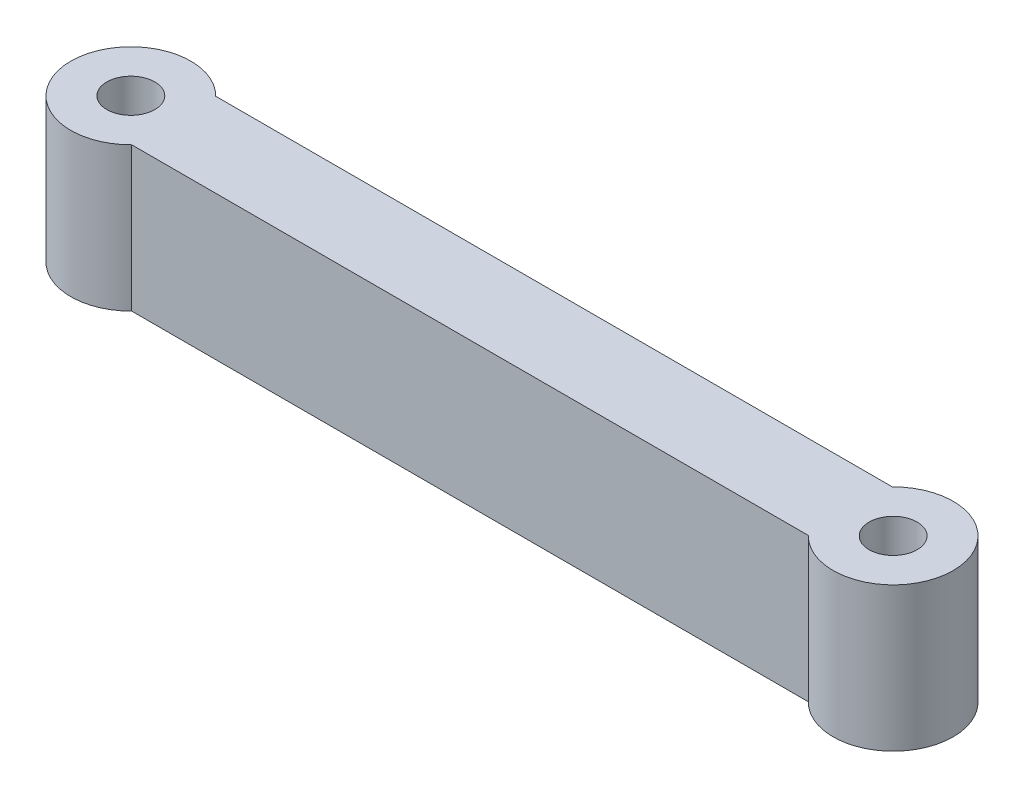
ISO-10303-21;
HEADER;
FILE_DESCRIPTION(('STEP AP214'),'2;1');
FILE_NAME('part.step','',(''),(''),'','','');
FILE_SCHEMA(('AUTOMOTIVE_DESIGN { 1 0 10303 214 1 1 1 1 }'));
ENDSEC;
DATA;
#1=APPLICATION_CONTEXT('core data for automotive mechanical design processes');
#2=APPLICATION_PROTOCOL_DEFINITION('international standard','automotive_design',2000,#1);
#3=PRODUCT_CONTEXT('',#1,'mechanical');
#4=PRODUCT('Part','Part','',(#3));
#5=PRODUCT_RELATED_PRODUCT_CATEGORY('part','',(#4));
#6=PRODUCT_DEFINITION_FORMATION('','',#4);
#7=PRODUCT_DEFINITION_CONTEXT('part definition',#1,'design');
#8=PRODUCT_DEFINITION('design','',#6,#7);
#9=PRODUCT_DEFINITION_SHAPE('','',#8);
#10=(LENGTH_UNIT() NAMED_UNIT(*) SI_UNIT(.MILLI.,.METRE.));
#11=(NAMED_UNIT(*) PLANE_ANGLE_UNIT() SI_UNIT($,.RADIAN.));
#12=(NAMED_UNIT(*) SI_UNIT($,.STERADIAN.) SOLID_ANGLE_UNIT());
#13=UNCERTAINTY_MEASURE_WITH_UNIT(LENGTH_MEASURE(1.E-05),#10,'distance_accuracy_value','');
#14=(GEOMETRIC_REPRESENTATION_CONTEXT(3) GLOBAL_UNCERTAINTY_ASSIGNED_CONTEXT((#13)) GLOBAL_UNIT_ASSIGNED_CONTEXT((#10,
#11,#12)) REPRESENTATION_CONTEXT('',''));
#15=CARTESIAN_POINT('',(0.,0.,0.));
#16=DIRECTION('',(0.,0.,1.));
#17=DIRECTION('',(1.,0.,0.));
#18=AXIS2_PLACEMENT_3D('',#15,#16,#17);
#19=CARTESIAN_POINT('',(0.,12.,0.));
#20=DIRECTION('',(0.,1.,0.));
#21=DIRECTION('',(0.,0.,1.));
#22=AXIS2_PLACEMENT_3D('',#19,#20,#21);
#23=PLANE('',#22);
#24=CARTESIAN_POINT('',(-31.75,12.,0.));
#25=DIRECTION('',(0.,1.,0.));
#26=DIRECTION('',(0.,0.,1.));
#27=AXIS2_PLACEMENT_3D('',#24,#25,#26);
#28=CIRCLE('',#27,2.);
#29=CARTESIAN_POINT('',(-31.75,12.,2.));
#30=VERTEX_POINT('',#29);
#31=EDGE_CURVE('E181',#30,#30,#28,.T.);
#32=ORIENTED_EDGE('',*,*,#31,.F.);
#33=EDGE_LOOP('',(#32));
#34=FACE_BOUND('',#33,.T.);
#35=CARTESIAN_POINT('',(31.75,12.,0.));
#36=DIRECTION('',(0.,1.,0.));
#37=DIRECTION('',(0.,0.,1.));
#38=AXIS2_PLACEMENT_3D('',#35,#36,#37);
#39=CIRCLE('',#38,2.);
#40=CARTESIAN_POINT('',(31.75,12.,2.));
#41=VERTEX_POINT('',#40);
#42=EDGE_CURVE('E183',#41,#41,#39,.T.);
#43=ORIENTED_EDGE('',*,*,#42,.F.);
#44=EDGE_LOOP('',(#43));
#45=FACE_BOUND('',#44,.T.);
#46=CARTESIAN_POINT('',(-31.75,12.,0.));
#47=DIRECTION('',(0.,1.,0.));
#48=DIRECTION('',(0.,0.,1.));
#49=AXIS2_PLACEMENT_3D('',#46,#47,#48);
#50=CIRCLE('',#49,5.);
#51=CARTESIAN_POINT('',(-28.1792857857286,12.,-3.5));
#52=VERTEX_POINT('',#51);
#53=CARTESIAN_POINT('',(-28.1792857857286,12.,3.5));
#54=VERTEX_POINT('',#53);
#55=EDGE_CURVE('E37',#52,#54,#50,.T.);
#56=ORIENTED_EDGE('',*,*,#55,.T.);
#57=DIRECTION('',(1.,0.,0.));
#58=VECTOR('',#57,1.);
#59=CARTESIAN_POINT('',(-28.1792857857286,12.,3.5));
#60=LINE('',#59,#58);
#61=CARTESIAN_POINT('',(28.1792857857286,12.,3.5));
#62=VERTEX_POINT('',#61);
#63=EDGE_CURVE('E48',#54,#62,#60,.T.);
#64=ORIENTED_EDGE('',*,*,#63,.T.);
#65=CARTESIAN_POINT('',(31.75,12.,0.));
#66=DIRECTION('',(0.,1.,0.));
#67=DIRECTION('',(0.,0.,1.));
#68=AXIS2_PLACEMENT_3D('',#65,#66,#67);
#69=CIRCLE('',#68,5.);
#70=CARTESIAN_POINT('',(28.1792857857286,12.,-3.5));
#71=VERTEX_POINT('',#70);
#72=EDGE_CURVE('E103',#62,#71,#69,.T.);
#73=ORIENTED_EDGE('',*,*,#72,.T.);
#74=DIRECTION('',(-1.,0.,0.));
#75=VECTOR('',#74,1.);
#76=CARTESIAN_POINT('',(-28.1792857857286,12.,-3.5));
#77=LINE('',#76,#75);
#78=EDGE_CURVE('E97',#71,#52,#77,.T.);
#79=ORIENTED_EDGE('',*,*,#78,.T.);
#80=EDGE_LOOP('',(#56,#64,#73,#79));
#81=FACE_BOUND('',#80,.T.);
#82=ADVANCED_FACE('F33',(#34,#45,#81),#23,.T.);
#83=CARTESIAN_POINT('',(0.,0.,0.));
#84=DIRECTION('',(0.,1.,0.));
#85=DIRECTION('',(0.,0.,1.));
#86=AXIS2_PLACEMENT_3D('',#83,#84,#85);
#87=PLANE('',#86);
#88=CARTESIAN_POINT('',(-31.75,0.,0.));
#89=DIRECTION('',(0.,1.,0.));
#90=DIRECTION('',(0.,0.,1.));
#91=AXIS2_PLACEMENT_3D('',#88,#89,#90);
#92=CIRCLE('',#91,2.);
#93=CARTESIAN_POINT('',(-31.75,0.,2.));
#94=VERTEX_POINT('',#93);
#95=EDGE_CURVE('E179',#94,#94,#92,.T.);
#96=ORIENTED_EDGE('',*,*,#95,.T.);
#97=EDGE_LOOP('',(#96));
#98=FACE_BOUND('',#97,.T.);
#99=CARTESIAN_POINT('',(31.75,0.,0.));
#100=DIRECTION('',(0.,1.,0.));
#101=DIRECTION('',(0.,0.,1.));
#102=AXIS2_PLACEMENT_3D('',#99,#100,#101);
#103=CIRCLE('',#102,2.);
#104=CARTESIAN_POINT('',(31.75,0.,2.));
#105=VERTEX_POINT('',#104);
#106=EDGE_CURVE('E99',#105,#105,#103,.T.);
#107=ORIENTED_EDGE('',*,*,#106,.T.);
#108=EDGE_LOOP('',(#107));
#109=FACE_BOUND('',#108,.T.);
#110=CARTESIAN_POINT('',(-31.75,0.,0.));
#111=DIRECTION('',(0.,1.,0.));
#112=DIRECTION('',(0.,0.,1.));
#113=AXIS2_PLACEMENT_3D('',#110,#111,#112);
#114=CIRCLE('',#113,5.);
#115=CARTESIAN_POINT('',(-28.1792857857286,0.,-3.5));
#116=VERTEX_POINT('',#115);
#117=CARTESIAN_POINT('',(-28.1792857857286,0.,3.5));
#118=VERTEX_POINT('',#117);
#119=EDGE_CURVE('E11',#116,#118,#114,.T.);
#120=ORIENTED_EDGE('',*,*,#119,.F.);
#121=DIRECTION('',(-1.,0.,0.));
#122=VECTOR('',#121,1.);
#123=CARTESIAN_POINT('',(-28.1792857857286,0.,-3.5));
#124=LINE('',#123,#122);
#125=CARTESIAN_POINT('',(28.1792857857286,0.,-3.5));
#126=VERTEX_POINT('',#125);
#127=EDGE_CURVE('E77',#126,#116,#124,.T.);
#128=ORIENTED_EDGE('',*,*,#127,.F.);
#129=CARTESIAN_POINT('',(31.75,0.,0.));
#130=DIRECTION('',(0.,1.,0.));
#131=DIRECTION('',(0.,0.,1.));
#132=AXIS2_PLACEMENT_3D('',#129,#130,#131);
#133=CIRCLE('',#132,5.);
#134=CARTESIAN_POINT('',(28.1792857857286,0.,3.5));
#135=VERTEX_POINT('',#134);
#136=EDGE_CURVE('E92',#135,#126,#133,.T.);
#137=ORIENTED_EDGE('',*,*,#136,.F.);
#138=DIRECTION('',(1.,0.,0.));
#139=VECTOR('',#138,1.);
#140=CARTESIAN_POINT('',(-28.1792857857286,0.,3.5));
#141=LINE('',#140,#139);
#142=EDGE_CURVE('E56',#118,#135,#141,.T.);
#143=ORIENTED_EDGE('',*,*,#142,.F.);
#144=EDGE_LOOP('',(#120,#128,#137,#143));
#145=FACE_BOUND('',#144,.T.);
#146=ADVANCED_FACE('F35',(#98,#109,#145),#87,.F.);
#147=CARTESIAN_POINT('',(-31.75,0.,0.));
#148=DIRECTION('',(0.,1.,0.));
#149=DIRECTION('',(0.,0.,1.));
#150=AXIS2_PLACEMENT_3D('',#147,#148,#149);
#151=CYLINDRICAL_SURFACE('',#150,5.);
#152=DIRECTION('',(0.,1.,0.));
#153=VECTOR('',#152,1.);
#154=CARTESIAN_POINT('',(-28.1792857857286,0.,3.5));
#155=LINE('',#154,#153);
#156=EDGE_CURVE('E90',#118,#54,#155,.T.);
#157=ORIENTED_EDGE('',*,*,#156,.T.);
#158=ORIENTED_EDGE('',*,*,#55,.F.);
#159=DIRECTION('',(0.,1.,0.));
#160=VECTOR('',#159,1.);
#161=CARTESIAN_POINT('',(-28.1792857857286,0.,-3.5));
#162=LINE('',#161,#160);
#163=EDGE_CURVE('E80',#116,#52,#162,.T.);
#164=ORIENTED_EDGE('',*,*,#163,.F.);
#165=ORIENTED_EDGE('',*,*,#119,.T.);
#166=EDGE_LOOP('',(#157,#158,#164,#165));
#167=FACE_BOUND('',#166,.T.);
#168=ADVANCED_FACE('F89',(#167),#151,.T.);
#169=CARTESIAN_POINT('',(31.75,0.,0.));
#170=DIRECTION('',(0.,1.,0.));
#171=DIRECTION('',(0.,0.,1.));
#172=AXIS2_PLACEMENT_3D('',#169,#170,#171);
#173=CYLINDRICAL_SURFACE('',#172,5.);
#174=DIRECTION('',(0.,1.,0.));
#175=VECTOR('',#174,1.);
#176=CARTESIAN_POINT('',(28.1792857857286,0.,3.5));
#177=LINE('',#176,#175);
#178=EDGE_CURVE('E101',#135,#62,#177,.T.);
#179=ORIENTED_EDGE('',*,*,#178,.F.);
#180=ORIENTED_EDGE('',*,*,#136,.T.);
#181=DIRECTION('',(0.,1.,0.));
#182=VECTOR('',#181,1.);
#183=CARTESIAN_POINT('',(28.1792857857286,0.,-3.5));
#184=LINE('',#183,#182);
#185=EDGE_CURVE('E75',#126,#71,#184,.T.);
#186=ORIENTED_EDGE('',*,*,#185,.T.);
#187=ORIENTED_EDGE('',*,*,#72,.F.);
#188=EDGE_LOOP('',(#179,#180,#186,#187));
#189=FACE_BOUND('',#188,.T.);
#190=ADVANCED_FACE('F108',(#189),#173,.T.);
#191=CARTESIAN_POINT('',(-28.1792857857286,0.,-3.5));
#192=DIRECTION('',(0.,0.,-1.));
#193=DIRECTION('',(-1.,0.,0.));
#194=AXIS2_PLACEMENT_3D('',#191,#192,#193);
#195=PLANE('',#194);
#196=ORIENTED_EDGE('',*,*,#78,.F.);
#197=ORIENTED_EDGE('',*,*,#185,.F.);
#198=ORIENTED_EDGE('',*,*,#127,.T.);
#199=ORIENTED_EDGE('',*,*,#163,.T.);
#200=EDGE_LOOP('',(#196,#197,#198,#199));
#201=FACE_BOUND('',#200,.T.);
#202=ADVANCED_FACE('F79',(#201),#195,.T.);
#203=CARTESIAN_POINT('',(-28.1792857857286,0.,3.5));
#204=DIRECTION('',(0.,0.,1.));
#205=DIRECTION('',(1.,0.,0.));
#206=AXIS2_PLACEMENT_3D('',#203,#204,#205);
#207=PLANE('',#206);
#208=ORIENTED_EDGE('',*,*,#63,.F.);
#209=ORIENTED_EDGE('',*,*,#156,.F.);
#210=ORIENTED_EDGE('',*,*,#142,.T.);
#211=ORIENTED_EDGE('',*,*,#178,.T.);
#212=EDGE_LOOP('',(#208,#209,#210,#211));
#213=FACE_BOUND('',#212,.T.);
#214=ADVANCED_FACE('F109',(#213),#207,.T.);
#215=CARTESIAN_POINT('',(31.75,0.,0.));
#216=DIRECTION('',(0.,1.,0.));
#217=DIRECTION('',(0.,0.,1.));
#218=AXIS2_PLACEMENT_3D('',#215,#216,#217);
#219=CYLINDRICAL_SURFACE('',#218,2.);
#220=ORIENTED_EDGE('',*,*,#106,.F.);
#221=EDGE_LOOP('',(#220));
#222=FACE_BOUND('',#221,.T.);
#223=ORIENTED_EDGE('',*,*,#42,.T.);
#224=EDGE_LOOP('',(#223));
#225=FACE_BOUND('',#224,.T.);
#226=ADVANCED_FACE('F111',(#222,#225),#219,.F.);
#227=CARTESIAN_POINT('',(-31.75,0.,0.));
#228=DIRECTION('',(0.,1.,0.));
#229=DIRECTION('',(0.,0.,1.));
#230=AXIS2_PLACEMENT_3D('',#227,#228,#229);
#231=CYLINDRICAL_SURFACE('',#230,2.);
#232=ORIENTED_EDGE('',*,*,#95,.F.);
#233=EDGE_LOOP('',(#232));
#234=FACE_BOUND('',#233,.T.);
#235=ORIENTED_EDGE('',*,*,#31,.T.);
#236=EDGE_LOOP('',(#235));
#237=FACE_BOUND('',#236,.T.);
#238=ADVANCED_FACE('F117',(#234,#237),#231,.F.);
#239=CLOSED_SHELL('',(#82,#146,#168,#190,#202,#214,#226,#238));
#240=MANIFOLD_SOLID_BREP('B2',#239);
#241=ADVANCED_BREP_SHAPE_REPRESENTATION('',(#18,#240),#14);
#242=SHAPE_DEFINITION_REPRESENTATION(#9,#241);
ENDSEC;
END-ISO-10303-21;
